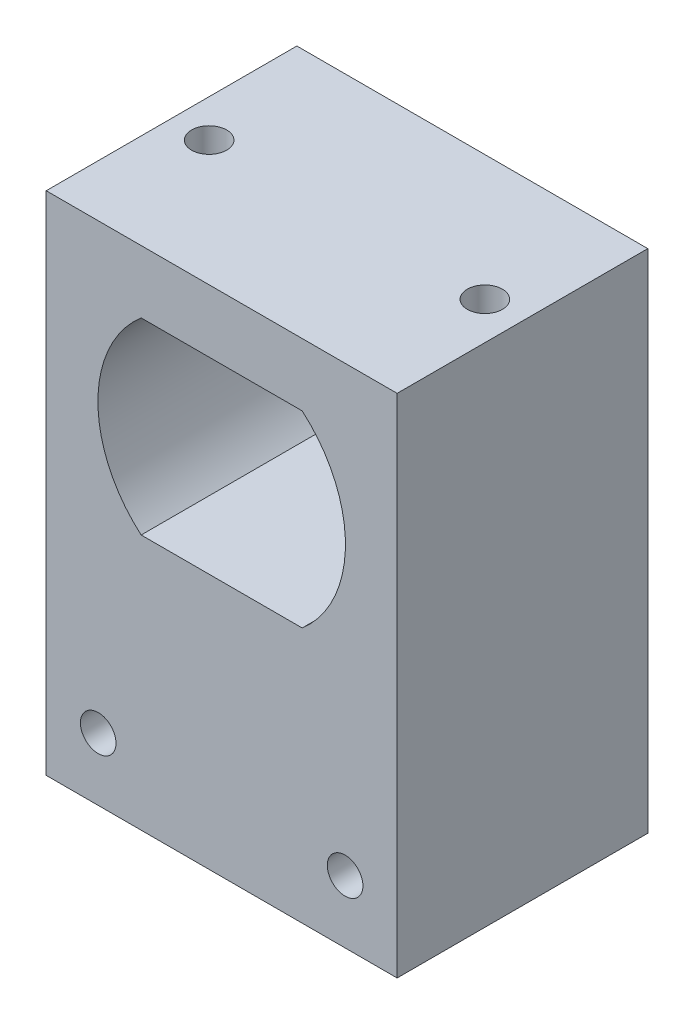
ISO-10303-21;
HEADER;
FILE_DESCRIPTION(('STEP AP214'),'2;1');
FILE_NAME('part.step','',(''),(''),'','','');
FILE_SCHEMA(('AUTOMOTIVE_DESIGN { 1 0 10303 214 1 1 1 1 }'));
ENDSEC;
DATA;
#1=APPLICATION_CONTEXT('core data for automotive mechanical design processes');
#2=APPLICATION_PROTOCOL_DEFINITION('international standard','automotive_design',2000,#1);
#3=PRODUCT_CONTEXT('',#1,'mechanical');
#4=PRODUCT('Part','Part','',(#3));
#5=PRODUCT_RELATED_PRODUCT_CATEGORY('part','',(#4));
#6=PRODUCT_DEFINITION_FORMATION('','',#4);
#7=PRODUCT_DEFINITION_CONTEXT('part definition',#1,'design');
#8=PRODUCT_DEFINITION('design','',#6,#7);
#9=PRODUCT_DEFINITION_SHAPE('','',#8);
#10=(LENGTH_UNIT() NAMED_UNIT(*) SI_UNIT(.MILLI.,.METRE.));
#11=(NAMED_UNIT(*) PLANE_ANGLE_UNIT() SI_UNIT($,.RADIAN.));
#12=(NAMED_UNIT(*) SI_UNIT($,.STERADIAN.) SOLID_ANGLE_UNIT());
#13=UNCERTAINTY_MEASURE_WITH_UNIT(LENGTH_MEASURE(1.E-05),#10,'distance_accuracy_value','');
#14=(GEOMETRIC_REPRESENTATION_CONTEXT(3) GLOBAL_UNCERTAINTY_ASSIGNED_CONTEXT((#13)) GLOBAL_UNIT_ASSIGNED_CONTEXT((#10,
#11,#12)) REPRESENTATION_CONTEXT('',''));
#15=CARTESIAN_POINT('',(0.,0.,0.));
#16=DIRECTION('',(0.,0.,1.));
#17=DIRECTION('',(1.,0.,0.));
#18=AXIS2_PLACEMENT_3D('',#15,#16,#17);
#19=CARTESIAN_POINT('',(0.,0.,0.));
#20=DIRECTION('',(0.,0.,1.));
#21=DIRECTION('',(1.,0.,0.));
#22=AXIS2_PLACEMENT_3D('',#19,#20,#21);
#23=PLANE('',#22);
#24=DIRECTION('',(0.,1.,0.));
#25=VECTOR('',#24,1.);
#26=CARTESIAN_POINT('',(14.,20.2,0.));
#27=LINE('',#26,#25);
#28=CARTESIAN_POINT('',(14.,-20.2,0.));
#29=VERTEX_POINT('',#28);
#30=CARTESIAN_POINT('',(14.,20.2,0.));
#31=VERTEX_POINT('',#30);
#32=EDGE_CURVE('E187',#29,#31,#27,.T.);
#33=ORIENTED_EDGE('',*,*,#32,.F.);
#34=DIRECTION('',(1.,0.,0.));
#35=VECTOR('',#34,1.);
#36=CARTESIAN_POINT('',(-14.,-20.2,0.));
#37=LINE('',#36,#35);
#38=CARTESIAN_POINT('',(-14.,-20.2,0.));
#39=VERTEX_POINT('',#38);
#40=EDGE_CURVE('E197',#39,#29,#37,.T.);
#41=ORIENTED_EDGE('',*,*,#40,.F.);
#42=DIRECTION('',(0.,-1.,0.));
#43=VECTOR('',#42,1.);
#44=CARTESIAN_POINT('',(-14.,20.2,0.));
#45=LINE('',#44,#43);
#46=CARTESIAN_POINT('',(-14.,20.2,0.));
#47=VERTEX_POINT('',#46);
#48=EDGE_CURVE('E208',#47,#39,#45,.T.);
#49=ORIENTED_EDGE('',*,*,#48,.F.);
#50=DIRECTION('',(-1.,0.,0.));
#51=VECTOR('',#50,1.);
#52=CARTESIAN_POINT('',(-14.,20.2,0.));
#53=LINE('',#52,#51);
#54=EDGE_CURVE('E206',#31,#47,#53,.T.);
#55=ORIENTED_EDGE('',*,*,#54,.F.);
#56=EDGE_LOOP('',(#33,#41,#49,#55));
#57=FACE_BOUND('',#56,.T.);
#58=DIRECTION('',(-1.,0.,0.));
#59=VECTOR('',#58,1.);
#60=CARTESIAN_POINT('',(-6.4238325787648,15.2,0.));
#61=LINE('',#60,#59);
#62=CARTESIAN_POINT('',(6.4238325787648,15.2,0.));
#63=VERTEX_POINT('',#62);
#64=CARTESIAN_POINT('',(-6.4238325787648,15.2,0.));
#65=VERTEX_POINT('',#64);
#66=EDGE_CURVE('E172',#63,#65,#61,.T.);
#67=ORIENTED_EDGE('',*,*,#66,.T.);
#68=CARTESIAN_POINT('',(0.,7.7,0.));
#69=DIRECTION('',(0.,0.,1.));
#70=DIRECTION('',(1.,0.,0.));
#71=AXIS2_PLACEMENT_3D('',#68,#69,#70);
#72=CIRCLE('',#71,9.875);
#73=CARTESIAN_POINT('',(-6.4238325787648,0.200000000000002,0.));
#74=VERTEX_POINT('',#73);
#75=EDGE_CURVE('E162',#65,#74,#72,.T.);
#76=ORIENTED_EDGE('',*,*,#75,.T.);
#77=DIRECTION('',(1.,0.,0.));
#78=VECTOR('',#77,1.);
#79=CARTESIAN_POINT('',(-6.4238325787648,0.200000000000002,0.));
#80=LINE('',#79,#78);
#81=CARTESIAN_POINT('',(6.4238325787648,0.200000000000002,0.));
#82=VERTEX_POINT('',#81);
#83=EDGE_CURVE('E165',#74,#82,#80,.T.);
#84=ORIENTED_EDGE('',*,*,#83,.T.);
#85=CARTESIAN_POINT('',(0.,7.7,0.));
#86=DIRECTION('',(0.,0.,1.));
#87=DIRECTION('',(1.,0.,0.));
#88=AXIS2_PLACEMENT_3D('',#85,#86,#87);
#89=CIRCLE('',#88,9.875);
#90=EDGE_CURVE('E169',#82,#63,#89,.T.);
#91=ORIENTED_EDGE('',*,*,#90,.T.);
#92=EDGE_LOOP('',(#67,#76,#84,#91));
#93=FACE_BOUND('',#92,.T.);
#94=DIRECTION('',(0.,-1.,0.));
#95=VECTOR('',#94,1.);
#96=CARTESIAN_POINT('',(-12.,-12.2,0.));
#97=LINE('',#96,#95);
#98=CARTESIAN_POINT('',(-12.,-12.2,0.));
#99=VERTEX_POINT('',#98);
#100=CARTESIAN_POINT('',(-12.,-18.2,0.));
#101=VERTEX_POINT('',#100);
#102=EDGE_CURVE('E49',#99,#101,#97,.T.);
#103=ORIENTED_EDGE('',*,*,#102,.T.);
#104=DIRECTION('',(1.,0.,0.));
#105=VECTOR('',#104,1.);
#106=CARTESIAN_POINT('',(12.,-18.2,0.));
#107=LINE('',#106,#105);
#108=CARTESIAN_POINT('',(12.,-18.2,0.));
#109=VERTEX_POINT('',#108);
#110=EDGE_CURVE('E143',#101,#109,#107,.T.);
#111=ORIENTED_EDGE('',*,*,#110,.T.);
#112=DIRECTION('',(0.,1.,0.));
#113=VECTOR('',#112,1.);
#114=CARTESIAN_POINT('',(12.,-12.2,0.));
#115=LINE('',#114,#113);
#116=CARTESIAN_POINT('',(12.,-12.2,0.));
#117=VERTEX_POINT('',#116);
#118=EDGE_CURVE('E347',#109,#117,#115,.T.);
#119=ORIENTED_EDGE('',*,*,#118,.T.);
#120=DIRECTION('',(-1.,0.,0.));
#121=VECTOR('',#120,1.);
#122=CARTESIAN_POINT('',(12.,-12.2,0.));
#123=LINE('',#122,#121);
#124=EDGE_CURVE('E139',#117,#99,#123,.T.);
#125=ORIENTED_EDGE('',*,*,#124,.T.);
#126=EDGE_LOOP('',(#103,#111,#119,#125));
#127=FACE_BOUND('',#126,.T.);
#128=ADVANCED_FACE('F34',(#57,#93,#127),#23,.F.);
#129=CARTESIAN_POINT('',(14.,20.2,20.));
#130=DIRECTION('',(-1.,0.,0.));
#131=DIRECTION('',(0.,-1.,0.));
#132=AXIS2_PLACEMENT_3D('',#129,#130,#131);
#133=PLANE('',#132);
#134=ORIENTED_EDGE('',*,*,#32,.T.);
#135=DIRECTION('',(0.,0.,-1.));
#136=VECTOR('',#135,1.);
#137=CARTESIAN_POINT('',(14.,20.2,20.));
#138=LINE('',#137,#136);
#139=CARTESIAN_POINT('',(14.,20.2,20.));
#140=VERTEX_POINT('',#139);
#141=EDGE_CURVE('E11',#140,#31,#138,.T.);
#142=ORIENTED_EDGE('',*,*,#141,.F.);
#143=DIRECTION('',(0.,1.,0.));
#144=VECTOR('',#143,1.);
#145=CARTESIAN_POINT('',(14.,20.2,20.));
#146=LINE('',#145,#144);
#147=CARTESIAN_POINT('',(14.,-20.2,20.));
#148=VERTEX_POINT('',#147);
#149=EDGE_CURVE('E193',#148,#140,#146,.T.);
#150=ORIENTED_EDGE('',*,*,#149,.F.);
#151=DIRECTION('',(0.,0.,-1.));
#152=VECTOR('',#151,1.);
#153=CARTESIAN_POINT('',(14.,-20.2,20.));
#154=LINE('',#153,#152);
#155=EDGE_CURVE('E203',#148,#29,#154,.T.);
#156=ORIENTED_EDGE('',*,*,#155,.T.);
#157=EDGE_LOOP('',(#134,#142,#150,#156));
#158=FACE_BOUND('',#157,.T.);
#159=ADVANCED_FACE('F36',(#158),#133,.F.);
#160=CARTESIAN_POINT('',(-14.,20.2,20.));
#161=DIRECTION('',(0.,-1.,0.));
#162=DIRECTION('',(0.,0.,-1.));
#163=AXIS2_PLACEMENT_3D('',#160,#161,#162);
#164=PLANE('',#163);
#165=CARTESIAN_POINT('',(-11.,20.2,10.));
#166=DIRECTION('',(0.,1.,0.));
#167=DIRECTION('',(0.,0.,1.));
#168=AXIS2_PLACEMENT_3D('',#165,#166,#167);
#169=CIRCLE('',#168,1.4);
#170=CARTESIAN_POINT('',(-11.,20.2,11.4));
#171=VERTEX_POINT('',#170);
#172=EDGE_CURVE('E331',#171,#171,#169,.T.);
#173=ORIENTED_EDGE('',*,*,#172,.F.);
#174=EDGE_LOOP('',(#173));
#175=FACE_BOUND('',#174,.T.);
#176=CARTESIAN_POINT('',(11.,20.2,10.));
#177=DIRECTION('',(0.,1.,0.));
#178=DIRECTION('',(0.,0.,1.));
#179=AXIS2_PLACEMENT_3D('',#176,#177,#178);
#180=CIRCLE('',#179,1.4);
#181=CARTESIAN_POINT('',(11.,20.2,11.4));
#182=VERTEX_POINT('',#181);
#183=EDGE_CURVE('E340',#182,#182,#180,.T.);
#184=ORIENTED_EDGE('',*,*,#183,.F.);
#185=EDGE_LOOP('',(#184));
#186=FACE_BOUND('',#185,.T.);
#187=ORIENTED_EDGE('',*,*,#54,.T.);
#188=DIRECTION('',(0.,0.,-1.));
#189=VECTOR('',#188,1.);
#190=CARTESIAN_POINT('',(-14.,20.2,20.));
#191=LINE('',#190,#189);
#192=CARTESIAN_POINT('',(-14.,20.2,20.));
#193=VERTEX_POINT('',#192);
#194=EDGE_CURVE('E42',#193,#47,#191,.T.);
#195=ORIENTED_EDGE('',*,*,#194,.F.);
#196=DIRECTION('',(-1.,0.,0.));
#197=VECTOR('',#196,1.);
#198=CARTESIAN_POINT('',(-14.,20.2,20.));
#199=LINE('',#198,#197);
#200=EDGE_CURVE('E196',#140,#193,#199,.T.);
#201=ORIENTED_EDGE('',*,*,#200,.F.);
#202=ORIENTED_EDGE('',*,*,#141,.T.);
#203=EDGE_LOOP('',(#187,#195,#201,#202));
#204=FACE_BOUND('',#203,.T.);
#205=ADVANCED_FACE('F236',(#175,#186,#204),#164,.F.);
#206=CARTESIAN_POINT('',(-14.,20.2,20.));
#207=DIRECTION('',(1.,0.,0.));
#208=DIRECTION('',(0.,1.,0.));
#209=AXIS2_PLACEMENT_3D('',#206,#207,#208);
#210=PLANE('',#209);
#211=ORIENTED_EDGE('',*,*,#48,.T.);
#212=DIRECTION('',(0.,0.,-1.));
#213=VECTOR('',#212,1.);
#214=CARTESIAN_POINT('',(-14.,-20.2,20.));
#215=LINE('',#214,#213);
#216=CARTESIAN_POINT('',(-14.,-20.2,20.));
#217=VERTEX_POINT('',#216);
#218=EDGE_CURVE('E213',#217,#39,#215,.T.);
#219=ORIENTED_EDGE('',*,*,#218,.F.);
#220=DIRECTION('',(0.,-1.,0.));
#221=VECTOR('',#220,1.);
#222=CARTESIAN_POINT('',(-14.,20.2,20.));
#223=LINE('',#222,#221);
#224=EDGE_CURVE('E199',#193,#217,#223,.T.);
#225=ORIENTED_EDGE('',*,*,#224,.F.);
#226=ORIENTED_EDGE('',*,*,#194,.T.);
#227=EDGE_LOOP('',(#211,#219,#225,#226));
#228=FACE_BOUND('',#227,.T.);
#229=ADVANCED_FACE('F220',(#228),#210,.F.);
#230=CARTESIAN_POINT('',(-14.,-20.2,20.));
#231=DIRECTION('',(0.,1.,0.));
#232=DIRECTION('',(0.,0.,1.));
#233=AXIS2_PLACEMENT_3D('',#230,#231,#232);
#234=PLANE('',#233);
#235=ORIENTED_EDGE('',*,*,#40,.T.);
#236=ORIENTED_EDGE('',*,*,#155,.F.);
#237=DIRECTION('',(1.,0.,0.));
#238=VECTOR('',#237,1.);
#239=CARTESIAN_POINT('',(-14.,-20.2,20.));
#240=LINE('',#239,#238);
#241=EDGE_CURVE('E201',#217,#148,#240,.T.);
#242=ORIENTED_EDGE('',*,*,#241,.F.);
#243=ORIENTED_EDGE('',*,*,#218,.T.);
#244=EDGE_LOOP('',(#235,#236,#242,#243));
#245=FACE_BOUND('',#244,.T.);
#246=ADVANCED_FACE('F229',(#245),#234,.F.);
#247=CARTESIAN_POINT('',(0.,0.,20.));
#248=DIRECTION('',(0.,0.,1.));
#249=DIRECTION('',(1.,0.,0.));
#250=AXIS2_PLACEMENT_3D('',#247,#248,#249);
#251=PLANE('',#250);
#252=CARTESIAN_POINT('',(-9.85,-15.2,20.));
#253=DIRECTION('',(0.,0.,1.));
#254=DIRECTION('',(1.,0.,0.));
#255=AXIS2_PLACEMENT_3D('',#252,#253,#254);
#256=CIRCLE('',#255,1.42);
#257=CARTESIAN_POINT('',(-8.43,-15.2,20.));
#258=VERTEX_POINT('',#257);
#259=EDGE_CURVE('E154',#258,#258,#256,.T.);
#260=ORIENTED_EDGE('',*,*,#259,.F.);
#261=EDGE_LOOP('',(#260));
#262=FACE_BOUND('',#261,.T.);
#263=CARTESIAN_POINT('',(9.85,-15.2,20.));
#264=DIRECTION('',(0.,0.,1.));
#265=DIRECTION('',(1.,0.,0.));
#266=AXIS2_PLACEMENT_3D('',#263,#264,#265);
#267=CIRCLE('',#266,1.42);
#268=CARTESIAN_POINT('',(11.27,-15.2,20.));
#269=VERTEX_POINT('',#268);
#270=EDGE_CURVE('E157',#269,#269,#267,.T.);
#271=ORIENTED_EDGE('',*,*,#270,.F.);
#272=EDGE_LOOP('',(#271));
#273=FACE_BOUND('',#272,.T.);
#274=CARTESIAN_POINT('',(0.,7.7,20.));
#275=DIRECTION('',(0.,0.,1.));
#276=DIRECTION('',(1.,0.,0.));
#277=AXIS2_PLACEMENT_3D('',#274,#275,#276);
#278=CIRCLE('',#277,9.875);
#279=CARTESIAN_POINT('',(-6.4238325787648,15.2,20.));
#280=VERTEX_POINT('',#279);
#281=CARTESIAN_POINT('',(-6.4238325787648,0.200000000000002,20.));
#282=VERTEX_POINT('',#281);
#283=EDGE_CURVE('E57',#280,#282,#278,.T.);
#284=ORIENTED_EDGE('',*,*,#283,.F.);
#285=DIRECTION('',(-1.,0.,0.));
#286=VECTOR('',#285,1.);
#287=CARTESIAN_POINT('',(-6.4238325787648,15.2,20.));
#288=LINE('',#287,#286);
#289=CARTESIAN_POINT('',(6.4238325787648,15.2,20.));
#290=VERTEX_POINT('',#289);
#291=EDGE_CURVE('E166',#290,#280,#288,.T.);
#292=ORIENTED_EDGE('',*,*,#291,.F.);
#293=CARTESIAN_POINT('',(0.,7.7,20.));
#294=DIRECTION('',(0.,0.,1.));
#295=DIRECTION('',(1.,0.,0.));
#296=AXIS2_PLACEMENT_3D('',#293,#294,#295);
#297=CIRCLE('',#296,9.875);
#298=CARTESIAN_POINT('',(6.4238325787648,0.200000000000001,20.));
#299=VERTEX_POINT('',#298);
#300=EDGE_CURVE('E180',#299,#290,#297,.T.);
#301=ORIENTED_EDGE('',*,*,#300,.F.);
#302=DIRECTION('',(1.,0.,0.));
#303=VECTOR('',#302,1.);
#304=CARTESIAN_POINT('',(-6.4238325787648,0.200000000000002,20.));
#305=LINE('',#304,#303);
#306=EDGE_CURVE('E177',#282,#299,#305,.T.);
#307=ORIENTED_EDGE('',*,*,#306,.F.);
#308=EDGE_LOOP('',(#284,#292,#301,#307));
#309=FACE_BOUND('',#308,.T.);
#310=ORIENTED_EDGE('',*,*,#149,.T.);
#311=ORIENTED_EDGE('',*,*,#200,.T.);
#312=ORIENTED_EDGE('',*,*,#224,.T.);
#313=ORIENTED_EDGE('',*,*,#241,.T.);
#314=EDGE_LOOP('',(#310,#311,#312,#313));
#315=FACE_BOUND('',#314,.T.);
#316=ADVANCED_FACE('F235',(#262,#273,#309,#315),#251,.T.);
#317=CARTESIAN_POINT('',(0.,7.7,0.));
#318=DIRECTION('',(0.,0.,1.));
#319=DIRECTION('',(1.,0.,0.));
#320=AXIS2_PLACEMENT_3D('',#317,#318,#319);
#321=CYLINDRICAL_SURFACE('',#320,9.875);
#322=ORIENTED_EDGE('',*,*,#283,.T.);
#323=DIRECTION('',(0.,0.,1.));
#324=VECTOR('',#323,1.);
#325=CARTESIAN_POINT('',(-6.4238325787648,0.200000000000002,0.));
#326=LINE('',#325,#324);
#327=EDGE_CURVE('E175',#74,#282,#326,.T.);
#328=ORIENTED_EDGE('',*,*,#327,.F.);
#329=ORIENTED_EDGE('',*,*,#75,.F.);
#330=DIRECTION('',(0.,0.,1.));
#331=VECTOR('',#330,1.);
#332=CARTESIAN_POINT('',(-6.4238325787648,15.2,0.));
#333=LINE('',#332,#331);
#334=EDGE_CURVE('E185',#65,#280,#333,.T.);
#335=ORIENTED_EDGE('',*,*,#334,.T.);
#336=EDGE_LOOP('',(#322,#328,#329,#335));
#337=FACE_BOUND('',#336,.T.);
#338=ADVANCED_FACE('F257',(#337),#321,.F.);
#339=CARTESIAN_POINT('',(-6.4238325787648,15.2,0.));
#340=DIRECTION('',(0.,1.,0.));
#341=DIRECTION('',(0.,0.,1.));
#342=AXIS2_PLACEMENT_3D('',#339,#340,#341);
#343=PLANE('',#342);
#344=ORIENTED_EDGE('',*,*,#291,.T.);
#345=ORIENTED_EDGE('',*,*,#334,.F.);
#346=ORIENTED_EDGE('',*,*,#66,.F.);
#347=DIRECTION('',(0.,0.,1.));
#348=VECTOR('',#347,1.);
#349=CARTESIAN_POINT('',(6.4238325787648,15.2,0.));
#350=LINE('',#349,#348);
#351=EDGE_CURVE('E188',#63,#290,#350,.T.);
#352=ORIENTED_EDGE('',*,*,#351,.T.);
#353=EDGE_LOOP('',(#344,#345,#346,#352));
#354=FACE_BOUND('',#353,.T.);
#355=ADVANCED_FACE('F262',(#354),#343,.F.);
#356=CARTESIAN_POINT('',(0.,7.7,0.));
#357=DIRECTION('',(0.,0.,1.));
#358=DIRECTION('',(1.,0.,0.));
#359=AXIS2_PLACEMENT_3D('',#356,#357,#358);
#360=CYLINDRICAL_SURFACE('',#359,9.875);
#361=ORIENTED_EDGE('',*,*,#300,.T.);
#362=ORIENTED_EDGE('',*,*,#351,.F.);
#363=ORIENTED_EDGE('',*,*,#90,.F.);
#364=DIRECTION('',(0.,0.,1.));
#365=VECTOR('',#364,1.);
#366=CARTESIAN_POINT('',(6.4238325787648,0.200000000000001,0.));
#367=LINE('',#366,#365);
#368=EDGE_CURVE('E190',#82,#299,#367,.T.);
#369=ORIENTED_EDGE('',*,*,#368,.T.);
#370=EDGE_LOOP('',(#361,#362,#363,#369));
#371=FACE_BOUND('',#370,.T.);
#372=ADVANCED_FACE('F279',(#371),#360,.F.);
#373=CARTESIAN_POINT('',(-6.4238325787648,0.200000000000002,0.));
#374=DIRECTION('',(0.,-1.,0.));
#375=DIRECTION('',(0.,0.,-1.));
#376=AXIS2_PLACEMENT_3D('',#373,#374,#375);
#377=PLANE('',#376);
#378=ORIENTED_EDGE('',*,*,#306,.T.);
#379=ORIENTED_EDGE('',*,*,#368,.F.);
#380=ORIENTED_EDGE('',*,*,#83,.F.);
#381=ORIENTED_EDGE('',*,*,#327,.T.);
#382=EDGE_LOOP('',(#378,#379,#380,#381));
#383=FACE_BOUND('',#382,.T.);
#384=ADVANCED_FACE('F272',(#383),#377,.F.);
#385=CARTESIAN_POINT('',(9.85,-15.2,10.));
#386=DIRECTION('',(0.,0.,1.));
#387=DIRECTION('',(1.,0.,0.));
#388=AXIS2_PLACEMENT_3D('',#385,#386,#387);
#389=CYLINDRICAL_SURFACE('',#388,1.42);
#390=CARTESIAN_POINT('',(9.85,-15.2,10.));
#391=DIRECTION('',(0.,0.,1.));
#392=DIRECTION('',(1.,0.,0.));
#393=AXIS2_PLACEMENT_3D('',#390,#391,#392);
#394=CIRCLE('',#393,1.42);
#395=CARTESIAN_POINT('',(11.27,-15.2,10.));
#396=VERTEX_POINT('',#395);
#397=EDGE_CURVE('E148',#396,#396,#394,.T.);
#398=ORIENTED_EDGE('',*,*,#397,.F.);
#399=EDGE_LOOP('',(#398));
#400=FACE_BOUND('',#399,.T.);
#401=ORIENTED_EDGE('',*,*,#270,.T.);
#402=EDGE_LOOP('',(#401));
#403=FACE_BOUND('',#402,.T.);
#404=ADVANCED_FACE('F286',(#400,#403),#389,.F.);
#405=CARTESIAN_POINT('',(-9.85,-15.2,10.));
#406=DIRECTION('',(0.,0.,1.));
#407=DIRECTION('',(1.,0.,0.));
#408=AXIS2_PLACEMENT_3D('',#405,#406,#407);
#409=CYLINDRICAL_SURFACE('',#408,1.42);
#410=CARTESIAN_POINT('',(-9.85,-15.2,10.));
#411=DIRECTION('',(0.,0.,1.));
#412=DIRECTION('',(1.,0.,0.));
#413=AXIS2_PLACEMENT_3D('',#410,#411,#412);
#414=CIRCLE('',#413,1.42);
#415=CARTESIAN_POINT('',(-8.43,-15.2,10.));
#416=VERTEX_POINT('',#415);
#417=EDGE_CURVE('E144',#416,#416,#414,.T.);
#418=ORIENTED_EDGE('',*,*,#417,.F.);
#419=EDGE_LOOP('',(#418));
#420=FACE_BOUND('',#419,.T.);
#421=ORIENTED_EDGE('',*,*,#259,.T.);
#422=EDGE_LOOP('',(#421));
#423=FACE_BOUND('',#422,.T.);
#424=ADVANCED_FACE('F292',(#420,#423),#409,.F.);
#425=CARTESIAN_POINT('',(0.,0.,10.));
#426=DIRECTION('',(0.,0.,-1.));
#427=DIRECTION('',(-1.,0.,0.));
#428=AXIS2_PLACEMENT_3D('',#425,#426,#427);
#429=PLANE('',#428);
#430=DIRECTION('',(0.,-1.,0.));
#431=VECTOR('',#430,1.);
#432=CARTESIAN_POINT('',(-12.,-12.2,10.));
#433=LINE('',#432,#431);
#434=CARTESIAN_POINT('',(-12.,-12.2,10.));
#435=VERTEX_POINT('',#434);
#436=CARTESIAN_POINT('',(-12.,-18.2,10.));
#437=VERTEX_POINT('',#436);
#438=EDGE_CURVE('E130',#435,#437,#433,.T.);
#439=ORIENTED_EDGE('',*,*,#438,.F.);
#440=DIRECTION('',(-1.,0.,0.));
#441=VECTOR('',#440,1.);
#442=CARTESIAN_POINT('',(12.,-12.2,10.));
#443=LINE('',#442,#441);
#444=CARTESIAN_POINT('',(12.,-12.2,10.));
#445=VERTEX_POINT('',#444);
#446=EDGE_CURVE('E344',#445,#435,#443,.T.);
#447=ORIENTED_EDGE('',*,*,#446,.F.);
#448=DIRECTION('',(0.,1.,0.));
#449=VECTOR('',#448,1.);
#450=CARTESIAN_POINT('',(12.,-12.2,10.));
#451=LINE('',#450,#449);
#452=CARTESIAN_POINT('',(12.,-18.2,10.));
#453=VERTEX_POINT('',#452);
#454=EDGE_CURVE('E131',#453,#445,#451,.T.);
#455=ORIENTED_EDGE('',*,*,#454,.F.);
#456=DIRECTION('',(1.,0.,0.));
#457=VECTOR('',#456,1.);
#458=CARTESIAN_POINT('',(12.,-18.2,10.));
#459=LINE('',#458,#457);
#460=EDGE_CURVE('E125',#437,#453,#459,.T.);
#461=ORIENTED_EDGE('',*,*,#460,.F.);
#462=EDGE_LOOP('',(#439,#447,#455,#461));
#463=FACE_BOUND('',#462,.T.);
#464=ORIENTED_EDGE('',*,*,#417,.T.);
#465=EDGE_LOOP('',(#464));
#466=FACE_BOUND('',#465,.T.);
#467=ORIENTED_EDGE('',*,*,#397,.T.);
#468=EDGE_LOOP('',(#467));
#469=FACE_BOUND('',#468,.T.);
#470=ADVANCED_FACE('F127',(#463,#466,#469),#429,.T.);
#471=CARTESIAN_POINT('',(-12.,-12.2,10.));
#472=DIRECTION('',(1.,0.,0.));
#473=DIRECTION('',(0.,0.,-1.));
#474=AXIS2_PLACEMENT_3D('',#471,#472,#473);
#475=PLANE('',#474);
#476=ORIENTED_EDGE('',*,*,#102,.F.);
#477=DIRECTION('',(0.,0.,-1.));
#478=VECTOR('',#477,1.);
#479=CARTESIAN_POINT('',(-12.,-12.2,10.));
#480=LINE('',#479,#478);
#481=EDGE_CURVE('E138',#435,#99,#480,.T.);
#482=ORIENTED_EDGE('',*,*,#481,.F.);
#483=ORIENTED_EDGE('',*,*,#438,.T.);
#484=DIRECTION('',(0.,0.,-1.));
#485=VECTOR('',#484,1.);
#486=CARTESIAN_POINT('',(-12.,-18.2,10.));
#487=LINE('',#486,#485);
#488=EDGE_CURVE('E137',#437,#101,#487,.T.);
#489=ORIENTED_EDGE('',*,*,#488,.T.);
#490=EDGE_LOOP('',(#476,#482,#483,#489));
#491=FACE_BOUND('',#490,.T.);
#492=ADVANCED_FACE('F136',(#491),#475,.T.);
#493=CARTESIAN_POINT('',(12.,-18.2,10.));
#494=DIRECTION('',(0.,1.,0.));
#495=DIRECTION('',(-1.,0.,0.));
#496=AXIS2_PLACEMENT_3D('',#493,#494,#495);
#497=PLANE('',#496);
#498=ORIENTED_EDGE('',*,*,#110,.F.);
#499=ORIENTED_EDGE('',*,*,#488,.F.);
#500=ORIENTED_EDGE('',*,*,#460,.T.);
#501=DIRECTION('',(0.,0.,-1.));
#502=VECTOR('',#501,1.);
#503=CARTESIAN_POINT('',(12.,-18.2,10.));
#504=LINE('',#503,#502);
#505=EDGE_CURVE('E145',#453,#109,#504,.T.);
#506=ORIENTED_EDGE('',*,*,#505,.T.);
#507=EDGE_LOOP('',(#498,#499,#500,#506));
#508=FACE_BOUND('',#507,.T.);
#509=ADVANCED_FACE('F141',(#508),#497,.T.);
#510=CARTESIAN_POINT('',(12.,-12.2,10.));
#511=DIRECTION('',(-1.,0.,0.));
#512=DIRECTION('',(0.,0.,1.));
#513=AXIS2_PLACEMENT_3D('',#510,#511,#512);
#514=PLANE('',#513);
#515=ORIENTED_EDGE('',*,*,#118,.F.);
#516=ORIENTED_EDGE('',*,*,#505,.F.);
#517=ORIENTED_EDGE('',*,*,#454,.T.);
#518=DIRECTION('',(0.,0.,-1.));
#519=VECTOR('',#518,1.);
#520=CARTESIAN_POINT('',(12.,-12.2,10.));
#521=LINE('',#520,#519);
#522=EDGE_CURVE('E150',#445,#117,#521,.T.);
#523=ORIENTED_EDGE('',*,*,#522,.T.);
#524=EDGE_LOOP('',(#515,#516,#517,#523));
#525=FACE_BOUND('',#524,.T.);
#526=ADVANCED_FACE('F301',(#525),#514,.T.);
#527=CARTESIAN_POINT('',(12.,-12.2,10.));
#528=DIRECTION('',(0.,-1.,0.));
#529=DIRECTION('',(0.,0.,-1.));
#530=AXIS2_PLACEMENT_3D('',#527,#528,#529);
#531=PLANE('',#530);
#532=ORIENTED_EDGE('',*,*,#124,.F.);
#533=ORIENTED_EDGE('',*,*,#522,.F.);
#534=ORIENTED_EDGE('',*,*,#446,.T.);
#535=ORIENTED_EDGE('',*,*,#481,.T.);
#536=EDGE_LOOP('',(#532,#533,#534,#535));
#537=FACE_BOUND('',#536,.T.);
#538=ADVANCED_FACE('F304',(#537),#531,.T.);
#539=CARTESIAN_POINT('',(11.,12.2,10.));
#540=DIRECTION('',(0.,1.,0.));
#541=DIRECTION('',(0.,0.,1.));
#542=AXIS2_PLACEMENT_3D('',#539,#540,#541);
#543=CYLINDRICAL_SURFACE('',#542,1.4);
#544=CARTESIAN_POINT('',(11.,12.2,10.));
#545=DIRECTION('',(0.,1.,0.));
#546=DIRECTION('',(0.,0.,1.));
#547=AXIS2_PLACEMENT_3D('',#544,#545,#546);
#548=CIRCLE('',#547,1.4);
#549=CARTESIAN_POINT('',(11.,12.2,11.4));
#550=VERTEX_POINT('',#549);
#551=EDGE_CURVE('E335',#550,#550,#548,.T.);
#552=ORIENTED_EDGE('',*,*,#551,.F.);
#553=EDGE_LOOP('',(#552));
#554=FACE_BOUND('',#553,.T.);
#555=ORIENTED_EDGE('',*,*,#183,.T.);
#556=EDGE_LOOP('',(#555));
#557=FACE_BOUND('',#556,.T.);
#558=ADVANCED_FACE('F308',(#554,#557),#543,.F.);
#559=CARTESIAN_POINT('',(11.,12.2,10.));
#560=DIRECTION('',(0.,1.,0.));
#561=DIRECTION('',(0.,0.,1.));
#562=AXIS2_PLACEMENT_3D('',#559,#560,#561);
#563=PLANE('',#562);
#564=ORIENTED_EDGE('',*,*,#551,.T.);
#565=EDGE_LOOP('',(#564));
#566=FACE_BOUND('',#565,.T.);
#567=ADVANCED_FACE('F314',(#566),#563,.T.);
#568=CARTESIAN_POINT('',(-11.,12.2,10.));
#569=DIRECTION('',(0.,1.,0.));
#570=DIRECTION('',(0.,0.,1.));
#571=AXIS2_PLACEMENT_3D('',#568,#569,#570);
#572=CYLINDRICAL_SURFACE('',#571,1.4);
#573=CARTESIAN_POINT('',(-11.,12.2,10.));
#574=DIRECTION('',(0.,1.,0.));
#575=DIRECTION('',(0.,0.,1.));
#576=AXIS2_PLACEMENT_3D('',#573,#574,#575);
#577=CIRCLE('',#576,1.4);
#578=CARTESIAN_POINT('',(-11.,12.2,11.4));
#579=VERTEX_POINT('',#578);
#580=EDGE_CURVE('E330',#579,#579,#577,.T.);
#581=ORIENTED_EDGE('',*,*,#580,.F.);
#582=EDGE_LOOP('',(#581));
#583=FACE_BOUND('',#582,.T.);
#584=ORIENTED_EDGE('',*,*,#172,.T.);
#585=EDGE_LOOP('',(#584));
#586=FACE_BOUND('',#585,.T.);
#587=ADVANCED_FACE('F318',(#583,#586),#572,.F.);
#588=CARTESIAN_POINT('',(-11.,12.2,10.));
#589=DIRECTION('',(0.,1.,0.));
#590=DIRECTION('',(0.,0.,1.));
#591=AXIS2_PLACEMENT_3D('',#588,#589,#590);
#592=PLANE('',#591);
#593=ORIENTED_EDGE('',*,*,#580,.T.);
#594=EDGE_LOOP('',(#593));
#595=FACE_BOUND('',#594,.T.);
#596=ADVANCED_FACE('F322',(#595),#592,.T.);
#597=CLOSED_SHELL('',(#128,#159,#205,#229,#246,#316,#338,#355,#372,#384,#404,#424,#470,#492,
#509,#526,#538,#558,#567,#587,#596));
#598=MANIFOLD_SOLID_BREP('B2',#597);
#599=ADVANCED_BREP_SHAPE_REPRESENTATION('',(#18,#598),#14);
#600=SHAPE_DEFINITION_REPRESENTATION(#9,#599);
ENDSEC;
END-ISO-10303-21;
